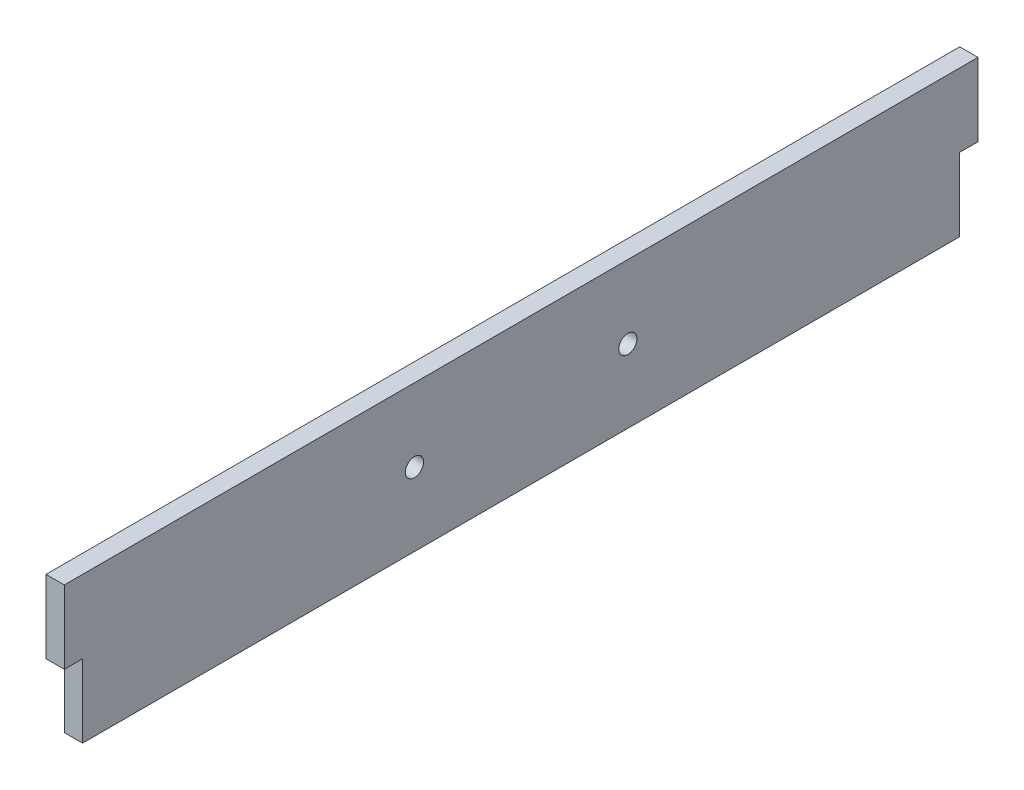
ISO-10303-21;
HEADER;
FILE_DESCRIPTION(('STEP AP214'),'2;1');
FILE_NAME('part.step','',(''),(''),'','','');
FILE_SCHEMA(('AUTOMOTIVE_DESIGN { 1 0 10303 214 1 1 1 1 }'));
ENDSEC;
DATA;
#1=APPLICATION_CONTEXT('core data for automotive mechanical design processes');
#2=APPLICATION_PROTOCOL_DEFINITION('international standard','automotive_design',2000,#1);
#3=PRODUCT_CONTEXT('',#1,'mechanical');
#4=PRODUCT('Part','Part','',(#3));
#5=PRODUCT_RELATED_PRODUCT_CATEGORY('part','',(#4));
#6=PRODUCT_DEFINITION_FORMATION('','',#4);
#7=PRODUCT_DEFINITION_CONTEXT('part definition',#1,'design');
#8=PRODUCT_DEFINITION('design','',#6,#7);
#9=PRODUCT_DEFINITION_SHAPE('','',#8);
#10=(LENGTH_UNIT() NAMED_UNIT(*) SI_UNIT(.MILLI.,.METRE.));
#11=(NAMED_UNIT(*) PLANE_ANGLE_UNIT() SI_UNIT($,.RADIAN.));
#12=(NAMED_UNIT(*) SI_UNIT($,.STERADIAN.) SOLID_ANGLE_UNIT());
#13=UNCERTAINTY_MEASURE_WITH_UNIT(LENGTH_MEASURE(1.E-05),#10,'distance_accuracy_value','');
#14=(GEOMETRIC_REPRESENTATION_CONTEXT(3) GLOBAL_UNCERTAINTY_ASSIGNED_CONTEXT((#13)) GLOBAL_UNIT_ASSIGNED_CONTEXT((#10,
#11,#12)) REPRESENTATION_CONTEXT('',''));
#15=CARTESIAN_POINT('',(0.,0.,0.));
#16=DIRECTION('',(0.,0.,1.));
#17=DIRECTION('',(1.,0.,0.));
#18=AXIS2_PLACEMENT_3D('',#15,#16,#17);
#19=CARTESIAN_POINT('',(3.175,0.,0.));
#20=DIRECTION('',(0.,0.,-1.));
#21=DIRECTION('',(-1.,0.,0.));
#22=AXIS2_PLACEMENT_3D('',#19,#20,#21);
#23=PLANE('',#22);
#24=DIRECTION('',(0.,-1.,0.));
#25=VECTOR('',#24,1.);
#26=CARTESIAN_POINT('',(0.,0.,0.));
#27=LINE('',#26,#25);
#28=CARTESIAN_POINT('',(0.,25.4,0.));
#29=VERTEX_POINT('',#28);
#30=CARTESIAN_POINT('',(0.,12.7,0.));
#31=VERTEX_POINT('',#30);
#32=EDGE_CURVE('E133',#29,#31,#27,.T.);
#33=ORIENTED_EDGE('',*,*,#32,.T.);
#34=DIRECTION('',(-1.,0.,0.));
#35=VECTOR('',#34,1.);
#36=CARTESIAN_POINT('',(3.175,12.7,0.));
#37=LINE('',#36,#35);
#38=CARTESIAN_POINT('',(3.175,12.7,0.));
#39=VERTEX_POINT('',#38);
#40=EDGE_CURVE('E56',#39,#31,#37,.T.);
#41=ORIENTED_EDGE('',*,*,#40,.F.);
#42=DIRECTION('',(0.,-1.,0.));
#43=VECTOR('',#42,1.);
#44=CARTESIAN_POINT('',(3.175,0.,0.));
#45=LINE('',#44,#43);
#46=CARTESIAN_POINT('',(3.175,25.4,0.));
#47=VERTEX_POINT('',#46);
#48=EDGE_CURVE('E123',#47,#39,#45,.T.);
#49=ORIENTED_EDGE('',*,*,#48,.F.);
#50=DIRECTION('',(-1.,0.,0.));
#51=VECTOR('',#50,1.);
#52=CARTESIAN_POINT('',(3.175,25.4,0.));
#53=LINE('',#52,#51);
#54=EDGE_CURVE('E41',#47,#29,#53,.T.);
#55=ORIENTED_EDGE('',*,*,#54,.T.);
#56=EDGE_LOOP('',(#33,#41,#49,#55));
#57=FACE_BOUND('',#56,.T.);
#58=ADVANCED_FACE('F34',(#57),#23,.F.);
#59=CARTESIAN_POINT('',(3.175,0.,0.));
#60=DIRECTION('',(0.,1.,0.));
#61=DIRECTION('',(0.,0.,1.));
#62=AXIS2_PLACEMENT_3D('',#59,#60,#61);
#63=PLANE('',#62);
#64=DIRECTION('',(0.,0.,-1.));
#65=VECTOR('',#64,1.);
#66=CARTESIAN_POINT('',(0.,0.,0.));
#67=LINE('',#66,#65);
#68=CARTESIAN_POINT('',(0.,3.19189119579733E-13,-3.17499999999996));
#69=VERTEX_POINT('',#68);
#70=CARTESIAN_POINT('',(0.,0.,-155.575));
#71=VERTEX_POINT('',#70);
#72=EDGE_CURVE('E115',#69,#71,#67,.T.);
#73=ORIENTED_EDGE('',*,*,#72,.T.);
#74=DIRECTION('',(-1.,0.,0.));
#75=VECTOR('',#74,1.);
#76=CARTESIAN_POINT('',(3.175,0.,-155.575));
#77=LINE('',#76,#75);
#78=CARTESIAN_POINT('',(3.175,0.,-155.575));
#79=VERTEX_POINT('',#78);
#80=EDGE_CURVE('E48',#79,#71,#77,.T.);
#81=ORIENTED_EDGE('',*,*,#80,.F.);
#82=DIRECTION('',(0.,0.,-1.));
#83=VECTOR('',#82,1.);
#84=CARTESIAN_POINT('',(3.175,0.,0.));
#85=LINE('',#84,#83);
#86=CARTESIAN_POINT('',(3.175,3.19189119579733E-13,-3.17499999999996));
#87=VERTEX_POINT('',#86);
#88=EDGE_CURVE('E113',#87,#79,#85,.T.);
#89=ORIENTED_EDGE('',*,*,#88,.F.);
#90=DIRECTION('',(-1.,0.,0.));
#91=VECTOR('',#90,1.);
#92=CARTESIAN_POINT('',(3.175,3.19189119579733E-13,-3.17499999999996));
#93=LINE('',#92,#91);
#94=EDGE_CURVE('E166',#87,#69,#93,.T.);
#95=ORIENTED_EDGE('',*,*,#94,.T.);
#96=EDGE_LOOP('',(#73,#81,#89,#95));
#97=FACE_BOUND('',#96,.T.);
#98=ADVANCED_FACE('F111',(#97),#63,.F.);
#99=CARTESIAN_POINT('',(3.175,0.,-158.75));
#100=DIRECTION('',(0.,0.,1.));
#101=DIRECTION('',(1.,0.,0.));
#102=AXIS2_PLACEMENT_3D('',#99,#100,#101);
#103=PLANE('',#102);
#104=DIRECTION('',(0.,1.,0.));
#105=VECTOR('',#104,1.);
#106=CARTESIAN_POINT('',(3.175,0.,-158.75));
#107=LINE('',#106,#105);
#108=CARTESIAN_POINT('',(3.175,12.7,-158.75));
#109=VERTEX_POINT('',#108);
#110=CARTESIAN_POINT('',(3.175,25.4,-158.75));
#111=VERTEX_POINT('',#110);
#112=EDGE_CURVE('E122',#109,#111,#107,.T.);
#113=ORIENTED_EDGE('',*,*,#112,.F.);
#114=DIRECTION('',(-1.,0.,0.));
#115=VECTOR('',#114,1.);
#116=CARTESIAN_POINT('',(3.175,12.7,-158.75));
#117=LINE('',#116,#115);
#118=CARTESIAN_POINT('',(0.,12.7,-158.75));
#119=VERTEX_POINT('',#118);
#120=EDGE_CURVE('E136',#109,#119,#117,.T.);
#121=ORIENTED_EDGE('',*,*,#120,.T.);
#122=DIRECTION('',(0.,1.,0.));
#123=VECTOR('',#122,1.);
#124=CARTESIAN_POINT('',(0.,0.,-158.75));
#125=LINE('',#124,#123);
#126=CARTESIAN_POINT('',(0.,25.4,-158.75));
#127=VERTEX_POINT('',#126);
#128=EDGE_CURVE('E138',#119,#127,#125,.T.);
#129=ORIENTED_EDGE('',*,*,#128,.T.);
#130=DIRECTION('',(-1.,0.,0.));
#131=VECTOR('',#130,1.);
#132=CARTESIAN_POINT('',(3.175,25.4,-158.75));
#133=LINE('',#132,#131);
#134=EDGE_CURVE('E11',#111,#127,#133,.T.);
#135=ORIENTED_EDGE('',*,*,#134,.F.);
#136=EDGE_LOOP('',(#113,#121,#129,#135));
#137=FACE_BOUND('',#136,.T.);
#138=ADVANCED_FACE('F196',(#137),#103,.F.);
#139=CARTESIAN_POINT('',(3.175,25.4,0.));
#140=DIRECTION('',(0.,-1.,0.));
#141=DIRECTION('',(0.,0.,-1.));
#142=AXIS2_PLACEMENT_3D('',#139,#140,#141);
#143=PLANE('',#142);
#144=DIRECTION('',(0.,0.,1.));
#145=VECTOR('',#144,1.);
#146=CARTESIAN_POINT('',(0.,25.4,0.));
#147=LINE('',#146,#145);
#148=EDGE_CURVE('E128',#127,#29,#147,.T.);
#149=ORIENTED_EDGE('',*,*,#148,.T.);
#150=ORIENTED_EDGE('',*,*,#54,.F.);
#151=DIRECTION('',(0.,0.,1.));
#152=VECTOR('',#151,1.);
#153=CARTESIAN_POINT('',(3.175,25.4,0.));
#154=LINE('',#153,#152);
#155=EDGE_CURVE('E125',#111,#47,#154,.T.);
#156=ORIENTED_EDGE('',*,*,#155,.F.);
#157=ORIENTED_EDGE('',*,*,#134,.T.);
#158=EDGE_LOOP('',(#149,#150,#156,#157));
#159=FACE_BOUND('',#158,.T.);
#160=ADVANCED_FACE('F197',(#159),#143,.F.);
#161=CARTESIAN_POINT('',(3.175,0.,0.));
#162=DIRECTION('',(-1.,0.,0.));
#163=DIRECTION('',(0.,0.,1.));
#164=AXIS2_PLACEMENT_3D('',#161,#162,#163);
#165=PLANE('',#164);
#166=CARTESIAN_POINT('',(3.175,12.7,-60.833));
#167=DIRECTION('',(-1.,0.,0.));
#168=DIRECTION('',(0.,0.,-1.));
#169=AXIS2_PLACEMENT_3D('',#166,#167,#168);
#170=CIRCLE('',#169,1.5875);
#171=CARTESIAN_POINT('',(3.175,12.7,-62.4205));
#172=VERTEX_POINT('',#171);
#173=EDGE_CURVE('E172',#172,#172,#170,.T.);
#174=ORIENTED_EDGE('',*,*,#173,.T.);
#175=EDGE_LOOP('',(#174));
#176=FACE_BOUND('',#175,.T.);
#177=CARTESIAN_POINT('',(3.175,12.7,-97.917));
#178=DIRECTION('',(-1.,0.,0.));
#179=DIRECTION('',(0.,0.,1.));
#180=AXIS2_PLACEMENT_3D('',#177,#178,#179);
#181=CIRCLE('',#180,1.5875);
#182=CARTESIAN_POINT('',(3.175,12.7,-96.3295));
#183=VERTEX_POINT('',#182);
#184=EDGE_CURVE('E156',#183,#183,#181,.T.);
#185=ORIENTED_EDGE('',*,*,#184,.T.);
#186=EDGE_LOOP('',(#185));
#187=FACE_BOUND('',#186,.T.);
#188=DIRECTION('',(0.,1.,0.));
#189=VECTOR('',#188,1.);
#190=CARTESIAN_POINT('',(3.175,0.,-155.575));
#191=LINE('',#190,#189);
#192=CARTESIAN_POINT('',(3.175,12.7,-155.575));
#193=VERTEX_POINT('',#192);
#194=EDGE_CURVE('E98',#79,#193,#191,.T.);
#195=ORIENTED_EDGE('',*,*,#194,.T.);
#196=DIRECTION('',(0.,0.,-1.));
#197=VECTOR('',#196,1.);
#198=CARTESIAN_POINT('',(3.175,12.7,-158.75));
#199=LINE('',#198,#197);
#200=EDGE_CURVE('E105',#193,#109,#199,.T.);
#201=ORIENTED_EDGE('',*,*,#200,.T.);
#202=ORIENTED_EDGE('',*,*,#112,.T.);
#203=ORIENTED_EDGE('',*,*,#155,.T.);
#204=ORIENTED_EDGE('',*,*,#48,.T.);
#205=DIRECTION('',(0.,0.,-1.));
#206=VECTOR('',#205,1.);
#207=CARTESIAN_POINT('',(3.175,12.7,0.));
#208=LINE('',#207,#206);
#209=CARTESIAN_POINT('',(3.175,12.7,-3.17500000000001));
#210=VERTEX_POINT('',#209);
#211=EDGE_CURVE('E158',#39,#210,#208,.T.);
#212=ORIENTED_EDGE('',*,*,#211,.T.);
#213=DIRECTION('',(0.,-1.,0.));
#214=VECTOR('',#213,1.);
#215=CARTESIAN_POINT('',(3.175,3.19189119579733E-13,-3.17499999999996));
#216=LINE('',#215,#214);
#217=EDGE_CURVE('E121',#210,#87,#216,.T.);
#218=ORIENTED_EDGE('',*,*,#217,.T.);
#219=ORIENTED_EDGE('',*,*,#88,.T.);
#220=EDGE_LOOP('',(#195,#201,#202,#203,#204,#212,#218,#219));
#221=FACE_BOUND('',#220,.T.);
#222=ADVANCED_FACE('F118',(#176,#187,#221),#165,.F.);
#223=CARTESIAN_POINT('',(0.,0.,0.));
#224=DIRECTION('',(-1.,0.,0.));
#225=DIRECTION('',(0.,0.,1.));
#226=AXIS2_PLACEMENT_3D('',#223,#224,#225);
#227=PLANE('',#226);
#228=DIRECTION('',(0.,0.,-1.));
#229=VECTOR('',#228,1.);
#230=CARTESIAN_POINT('',(0.,12.7,-158.75));
#231=LINE('',#230,#229);
#232=CARTESIAN_POINT('',(0.,12.7,-155.575));
#233=VERTEX_POINT('',#232);
#234=EDGE_CURVE('E106',#233,#119,#231,.T.);
#235=ORIENTED_EDGE('',*,*,#234,.F.);
#236=DIRECTION('',(0.,1.,0.));
#237=VECTOR('',#236,1.);
#238=CARTESIAN_POINT('',(0.,0.,-155.575));
#239=LINE('',#238,#237);
#240=EDGE_CURVE('E168',#71,#233,#239,.T.);
#241=ORIENTED_EDGE('',*,*,#240,.F.);
#242=ORIENTED_EDGE('',*,*,#72,.F.);
#243=DIRECTION('',(0.,-1.,0.));
#244=VECTOR('',#243,1.);
#245=CARTESIAN_POINT('',(0.,3.19189119579733E-13,-3.17499999999996));
#246=LINE('',#245,#244);
#247=CARTESIAN_POINT('',(0.,12.7,-3.17500000000001));
#248=VERTEX_POINT('',#247);
#249=EDGE_CURVE('E155',#248,#69,#246,.T.);
#250=ORIENTED_EDGE('',*,*,#249,.F.);
#251=DIRECTION('',(0.,0.,-1.));
#252=VECTOR('',#251,1.);
#253=CARTESIAN_POINT('',(0.,12.7,0.));
#254=LINE('',#253,#252);
#255=EDGE_CURVE('E154',#31,#248,#254,.T.);
#256=ORIENTED_EDGE('',*,*,#255,.F.);
#257=ORIENTED_EDGE('',*,*,#32,.F.);
#258=ORIENTED_EDGE('',*,*,#148,.F.);
#259=ORIENTED_EDGE('',*,*,#128,.F.);
#260=EDGE_LOOP('',(#235,#241,#242,#250,#256,#257,#258,#259));
#261=FACE_BOUND('',#260,.T.);
#262=CARTESIAN_POINT('',(0.,12.7,-60.833));
#263=DIRECTION('',(-1.,0.,0.));
#264=DIRECTION('',(0.,0.,-1.));
#265=AXIS2_PLACEMENT_3D('',#262,#263,#264);
#266=CIRCLE('',#265,1.5875);
#267=CARTESIAN_POINT('',(0.,12.7,-62.4205));
#268=VERTEX_POINT('',#267);
#269=EDGE_CURVE('E176',#268,#268,#266,.T.);
#270=ORIENTED_EDGE('',*,*,#269,.F.);
#271=EDGE_LOOP('',(#270));
#272=FACE_BOUND('',#271,.T.);
#273=CARTESIAN_POINT('',(0.,12.7,-97.917));
#274=DIRECTION('',(-1.,0.,0.));
#275=DIRECTION('',(0.,0.,1.));
#276=AXIS2_PLACEMENT_3D('',#273,#274,#275);
#277=CIRCLE('',#276,1.5875);
#278=CARTESIAN_POINT('',(0.,12.7,-96.3295));
#279=VERTEX_POINT('',#278);
#280=EDGE_CURVE('E161',#279,#279,#277,.T.);
#281=ORIENTED_EDGE('',*,*,#280,.F.);
#282=EDGE_LOOP('',(#281));
#283=FACE_BOUND('',#282,.T.);
#284=ADVANCED_FACE('F150',(#261,#272,#283),#227,.T.);
#285=CARTESIAN_POINT('',(3.175,3.19189119579733E-13,-3.17499999999996));
#286=DIRECTION('',(0.,0.,-1.));
#287=DIRECTION('',(0.,1.,0.));
#288=AXIS2_PLACEMENT_3D('',#285,#286,#287);
#289=PLANE('',#288);
#290=ORIENTED_EDGE('',*,*,#249,.T.);
#291=ORIENTED_EDGE('',*,*,#94,.F.);
#292=ORIENTED_EDGE('',*,*,#217,.F.);
#293=DIRECTION('',(-1.,0.,0.));
#294=VECTOR('',#293,1.);
#295=CARTESIAN_POINT('',(3.175,12.7,-3.17500000000001));
#296=LINE('',#295,#294);
#297=EDGE_CURVE('E169',#210,#248,#296,.T.);
#298=ORIENTED_EDGE('',*,*,#297,.T.);
#299=EDGE_LOOP('',(#290,#291,#292,#298));
#300=FACE_BOUND('',#299,.T.);
#301=ADVANCED_FACE('F185',(#300),#289,.F.);
#302=CARTESIAN_POINT('',(3.175,12.7,0.));
#303=DIRECTION('',(0.,1.,0.));
#304=DIRECTION('',(0.,0.,1.));
#305=AXIS2_PLACEMENT_3D('',#302,#303,#304);
#306=PLANE('',#305);
#307=ORIENTED_EDGE('',*,*,#255,.T.);
#308=ORIENTED_EDGE('',*,*,#297,.F.);
#309=ORIENTED_EDGE('',*,*,#211,.F.);
#310=ORIENTED_EDGE('',*,*,#40,.T.);
#311=EDGE_LOOP('',(#307,#308,#309,#310));
#312=FACE_BOUND('',#311,.T.);
#313=ADVANCED_FACE('F183',(#312),#306,.F.);
#314=CARTESIAN_POINT('',(3.175,12.7,-97.917));
#315=DIRECTION('',(-1.,0.,0.));
#316=DIRECTION('',(0.,0.,1.));
#317=AXIS2_PLACEMENT_3D('',#314,#315,#316);
#318=CYLINDRICAL_SURFACE('',#317,1.5875);
#319=ORIENTED_EDGE('',*,*,#184,.F.);
#320=EDGE_LOOP('',(#319));
#321=FACE_BOUND('',#320,.T.);
#322=ORIENTED_EDGE('',*,*,#280,.T.);
#323=EDGE_LOOP('',(#322));
#324=FACE_BOUND('',#323,.T.);
#325=ADVANCED_FACE('F248',(#321,#324),#318,.F.);
#326=CARTESIAN_POINT('',(3.175,12.7,-60.833));
#327=DIRECTION('',(-1.,0.,0.));
#328=DIRECTION('',(0.,0.,1.));
#329=AXIS2_PLACEMENT_3D('',#326,#327,#328);
#330=CYLINDRICAL_SURFACE('',#329,1.5875);
#331=ORIENTED_EDGE('',*,*,#173,.F.);
#332=EDGE_LOOP('',(#331));
#333=FACE_BOUND('',#332,.T.);
#334=ORIENTED_EDGE('',*,*,#269,.T.);
#335=EDGE_LOOP('',(#334));
#336=FACE_BOUND('',#335,.T.);
#337=ADVANCED_FACE('F257',(#333,#336),#330,.F.);
#338=CARTESIAN_POINT('',(3.175,12.7,-158.75));
#339=DIRECTION('',(0.,1.,0.));
#340=DIRECTION('',(0.,0.,1.));
#341=AXIS2_PLACEMENT_3D('',#338,#339,#340);
#342=PLANE('',#341);
#343=ORIENTED_EDGE('',*,*,#234,.T.);
#344=ORIENTED_EDGE('',*,*,#120,.F.);
#345=ORIENTED_EDGE('',*,*,#200,.F.);
#346=DIRECTION('',(-1.,0.,0.));
#347=VECTOR('',#346,1.);
#348=CARTESIAN_POINT('',(3.175,12.7,-155.575));
#349=LINE('',#348,#347);
#350=EDGE_CURVE('E100',#193,#233,#349,.T.);
#351=ORIENTED_EDGE('',*,*,#350,.T.);
#352=EDGE_LOOP('',(#343,#344,#345,#351));
#353=FACE_BOUND('',#352,.T.);
#354=ADVANCED_FACE('F192',(#353),#342,.F.);
#355=CARTESIAN_POINT('',(3.175,0.,-155.575));
#356=DIRECTION('',(0.,0.,1.));
#357=DIRECTION('',(1.,0.,0.));
#358=AXIS2_PLACEMENT_3D('',#355,#356,#357);
#359=PLANE('',#358);
#360=ORIENTED_EDGE('',*,*,#240,.T.);
#361=ORIENTED_EDGE('',*,*,#350,.F.);
#362=ORIENTED_EDGE('',*,*,#194,.F.);
#363=ORIENTED_EDGE('',*,*,#80,.T.);
#364=EDGE_LOOP('',(#360,#361,#362,#363));
#365=FACE_BOUND('',#364,.T.);
#366=ADVANCED_FACE('F99',(#365),#359,.F.);
#367=CLOSED_SHELL('',(#58,#98,#138,#160,#222,#284,#301,#313,#325,#337,#354,#366));
#368=MANIFOLD_SOLID_BREP('B2',#367);
#369=ADVANCED_BREP_SHAPE_REPRESENTATION('',(#18,#368),#14);
#370=SHAPE_DEFINITION_REPRESENTATION(#9,#369);
ENDSEC;
END-ISO-10303-21;
